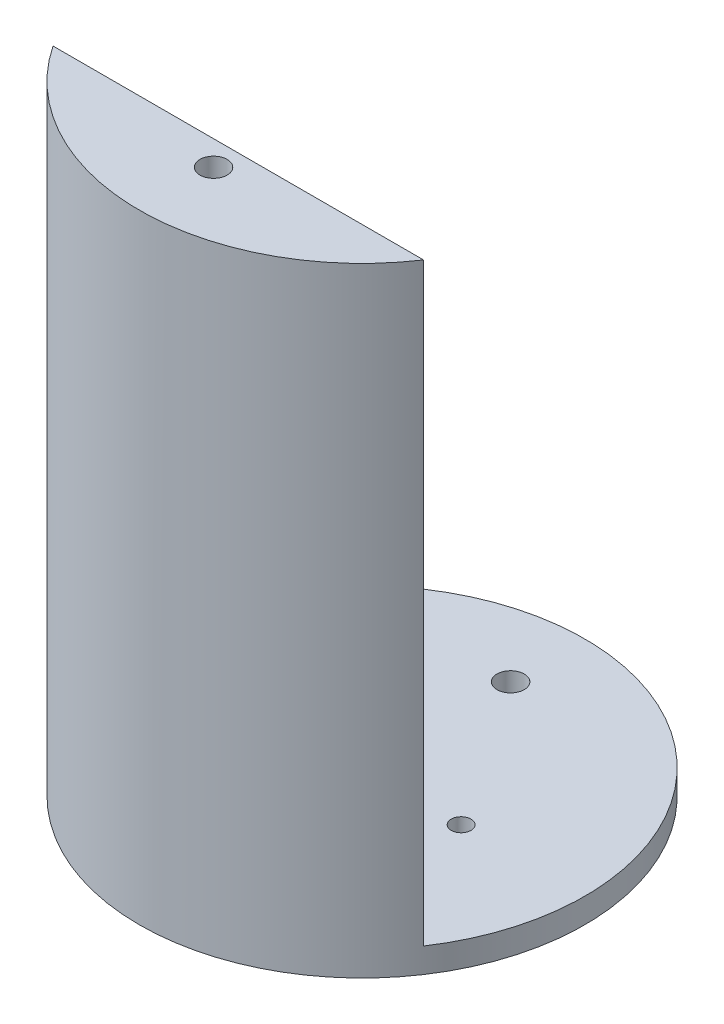
ISO-10303-21;
HEADER;
FILE_DESCRIPTION(('STEP AP214'),'2;1');
FILE_NAME('part.step','',(''),(''),'','','');
FILE_SCHEMA(('AUTOMOTIVE_DESIGN { 1 0 10303 214 1 1 1 1 }'));
ENDSEC;
DATA;
#1=APPLICATION_CONTEXT('core data for automotive mechanical design processes');
#2=APPLICATION_PROTOCOL_DEFINITION('international standard','automotive_design',2000,#1);
#3=PRODUCT_CONTEXT('',#1,'mechanical');
#4=PRODUCT('Part','Part','',(#3));
#5=PRODUCT_RELATED_PRODUCT_CATEGORY('part','',(#4));
#6=PRODUCT_DEFINITION_FORMATION('','',#4);
#7=PRODUCT_DEFINITION_CONTEXT('part definition',#1,'design');
#8=PRODUCT_DEFINITION('design','',#6,#7);
#9=PRODUCT_DEFINITION_SHAPE('','',#8);
#10=(LENGTH_UNIT() NAMED_UNIT(*) SI_UNIT(.MILLI.,.METRE.));
#11=(NAMED_UNIT(*) PLANE_ANGLE_UNIT() SI_UNIT($,.RADIAN.));
#12=(NAMED_UNIT(*) SI_UNIT($,.STERADIAN.) SOLID_ANGLE_UNIT());
#13=UNCERTAINTY_MEASURE_WITH_UNIT(LENGTH_MEASURE(1.E-05),#10,'distance_accuracy_value','');
#14=(GEOMETRIC_REPRESENTATION_CONTEXT(3) GLOBAL_UNCERTAINTY_ASSIGNED_CONTEXT((#13)) GLOBAL_UNIT_ASSIGNED_CONTEXT((#10,
#11,#12)) REPRESENTATION_CONTEXT('',''));
#15=CARTESIAN_POINT('',(0.,0.,0.));
#16=DIRECTION('',(0.,0.,1.));
#17=DIRECTION('',(1.,0.,0.));
#18=AXIS2_PLACEMENT_3D('',#15,#16,#17);
#19=CARTESIAN_POINT('',(0.,6.35,0.));
#20=DIRECTION('',(0.,1.,0.));
#21=DIRECTION('',(0.,0.,1.));
#22=AXIS2_PLACEMENT_3D('',#19,#20,#21);
#23=PLANE('',#22);
#24=CARTESIAN_POINT('',(0.,6.35,-38.1));
#25=DIRECTION('',(0.,1.,0.));
#26=DIRECTION('',(0.,0.,1.));
#27=AXIS2_PLACEMENT_3D('',#24,#25,#26);
#28=CIRCLE('',#27,3.4925);
#29=CARTESIAN_POINT('',(0.,6.35,-34.6075));
#30=VERTEX_POINT('',#29);
#31=EDGE_CURVE('E11',#30,#30,#28,.F.);
#32=ORIENTED_EDGE('',*,*,#31,.T.);
#33=EDGE_LOOP('',(#32));
#34=FACE_BOUND('',#33,.T.);
#35=CARTESIAN_POINT('',(0.,6.35,0.));
#36=DIRECTION('',(0.,1.,0.));
#37=DIRECTION('',(0.,0.,1.));
#38=AXIS2_PLACEMENT_3D('',#35,#36,#37);
#39=CIRCLE('',#38,6.35);
#40=CARTESIAN_POINT('',(0.,6.35,6.35));
#41=VERTEX_POINT('',#40);
#42=EDGE_CURVE('E92',#41,#41,#39,.T.);
#43=ORIENTED_EDGE('',*,*,#42,.F.);
#44=EDGE_LOOP('',(#43));
#45=FACE_BOUND('',#44,.T.);
#46=CARTESIAN_POINT('',(25.4,6.35,0.));
#47=DIRECTION('',(0.,1.,0.));
#48=DIRECTION('',(0.,0.,1.));
#49=AXIS2_PLACEMENT_3D('',#46,#47,#48);
#50=CIRCLE('',#49,2.52729999999999);
#51=CARTESIAN_POINT('',(25.4,6.35,2.52729999999999));
#52=VERTEX_POINT('',#51);
#53=EDGE_CURVE('E173',#52,#52,#50,.T.);
#54=ORIENTED_EDGE('',*,*,#53,.F.);
#55=EDGE_LOOP('',(#54));
#56=FACE_BOUND('',#55,.T.);
#57=CARTESIAN_POINT('',(-25.4,6.35,0.));
#58=DIRECTION('',(0.,1.,0.));
#59=DIRECTION('',(0.,0.,1.));
#60=AXIS2_PLACEMENT_3D('',#57,#58,#59);
#61=CIRCLE('',#60,2.52729999999999);
#62=CARTESIAN_POINT('',(-25.4,6.35,2.52729999999999));
#63=VERTEX_POINT('',#62);
#64=EDGE_CURVE('E83',#63,#63,#61,.T.);
#65=ORIENTED_EDGE('',*,*,#64,.F.);
#66=EDGE_LOOP('',(#65));
#67=FACE_BOUND('',#66,.T.);
#68=CARTESIAN_POINT('',(0.,6.35,0.));
#69=DIRECTION('',(0.,1.,0.));
#70=DIRECTION('',(0.,0.,1.));
#71=AXIS2_PLACEMENT_3D('',#68,#69,#70);
#72=CIRCLE('',#71,57.15);
#73=CARTESIAN_POINT('',(47.5190488120291,6.35,31.75));
#74=VERTEX_POINT('',#73);
#75=CARTESIAN_POINT('',(-47.5190488120291,6.35,31.75));
#76=VERTEX_POINT('',#75);
#77=EDGE_CURVE('E55',#74,#76,#72,.T.);
#78=ORIENTED_EDGE('',*,*,#77,.T.);
#79=DIRECTION('',(1.,0.,0.));
#80=VECTOR('',#79,1.);
#81=CARTESIAN_POINT('',(0.,6.35,31.75));
#82=LINE('',#81,#80);
#83=EDGE_CURVE('E85',#76,#74,#82,.T.);
#84=ORIENTED_EDGE('',*,*,#83,.T.);
#85=EDGE_LOOP('',(#78,#84));
#86=FACE_BOUND('',#85,.T.);
#87=ADVANCED_FACE('F45',(#34,#45,#56,#67,#86),#23,.T.);
#88=CARTESIAN_POINT('',(0.,6.35,38.1));
#89=DIRECTION('',(0.,-1.,0.));
#90=DIRECTION('',(0.,0.,-1.));
#91=AXIS2_PLACEMENT_3D('',#88,#89,#90);
#92=CYLINDRICAL_SURFACE('',#91,3.4925);
#93=CARTESIAN_POINT('',(0.,0.,38.1));
#94=DIRECTION('',(0.,1.,0.));
#95=DIRECTION('',(0.,0.,1.));
#96=AXIS2_PLACEMENT_3D('',#93,#94,#95);
#97=CIRCLE('',#96,3.4925);
#98=CARTESIAN_POINT('',(0.,0.,41.5925));
#99=VERTEX_POINT('',#98);
#100=EDGE_CURVE('E107',#99,#99,#97,.T.);
#101=ORIENTED_EDGE('',*,*,#100,.F.);
#102=EDGE_LOOP('',(#101));
#103=FACE_BOUND('',#102,.T.);
#104=CARTESIAN_POINT('',(0.,158.75,38.1));
#105=DIRECTION('',(0.,1.,0.));
#106=DIRECTION('',(0.,0.,1.));
#107=AXIS2_PLACEMENT_3D('',#104,#105,#106);
#108=CIRCLE('',#107,3.4925);
#109=CARTESIAN_POINT('',(0.,158.75,41.5925));
#110=VERTEX_POINT('',#109);
#111=EDGE_CURVE('E157',#110,#110,#108,.F.);
#112=ORIENTED_EDGE('',*,*,#111,.F.);
#113=EDGE_LOOP('',(#112));
#114=FACE_BOUND('',#113,.T.);
#115=ADVANCED_FACE('F136',(#103,#114),#92,.F.);
#116=CARTESIAN_POINT('',(0.,6.35,0.));
#117=DIRECTION('',(0.,-1.,0.));
#118=DIRECTION('',(0.,0.,-1.));
#119=AXIS2_PLACEMENT_3D('',#116,#117,#118);
#120=CYLINDRICAL_SURFACE('',#119,57.15);
#121=ORIENTED_EDGE('',*,*,#77,.F.);
#122=DIRECTION('',(0.,-1.,0.));
#123=VECTOR('',#122,1.);
#124=CARTESIAN_POINT('',(47.5190488120291,158.75,31.75));
#125=LINE('',#124,#123);
#126=CARTESIAN_POINT('',(47.5190488120291,158.75,31.75));
#127=VERTEX_POINT('',#126);
#128=EDGE_CURVE('E63',#127,#74,#125,.T.);
#129=ORIENTED_EDGE('',*,*,#128,.F.);
#130=CARTESIAN_POINT('',(0.,158.75,0.));
#131=DIRECTION('',(0.,1.,0.));
#132=DIRECTION('',(0.,0.,1.));
#133=AXIS2_PLACEMENT_3D('',#130,#131,#132);
#134=CIRCLE('',#133,57.15);
#135=CARTESIAN_POINT('',(-47.5190488120291,158.75,31.75));
#136=VERTEX_POINT('',#135);
#137=EDGE_CURVE('E71',#136,#127,#134,.T.);
#138=ORIENTED_EDGE('',*,*,#137,.F.);
#139=DIRECTION('',(0.,-1.,0.));
#140=VECTOR('',#139,1.);
#141=CARTESIAN_POINT('',(-47.5190488120291,158.75,31.75));
#142=LINE('',#141,#140);
#143=EDGE_CURVE('E78',#136,#76,#142,.T.);
#144=ORIENTED_EDGE('',*,*,#143,.T.);
#145=EDGE_LOOP('',(#121,#129,#138,#144));
#146=FACE_BOUND('',#145,.T.);
#147=CARTESIAN_POINT('',(0.,0.,0.));
#148=DIRECTION('',(0.,1.,0.));
#149=DIRECTION('',(0.,0.,1.));
#150=AXIS2_PLACEMENT_3D('',#147,#148,#149);
#151=CIRCLE('',#150,57.15);
#152=CARTESIAN_POINT('',(0.,0.,57.15));
#153=VERTEX_POINT('',#152);
#154=EDGE_CURVE('E103',#153,#153,#151,.T.);
#155=ORIENTED_EDGE('',*,*,#154,.T.);
#156=EDGE_LOOP('',(#155));
#157=FACE_BOUND('',#156,.T.);
#158=ADVANCED_FACE('F79',(#146,#157),#120,.T.);
#159=CARTESIAN_POINT('',(0.,6.35,0.));
#160=DIRECTION('',(0.,-1.,0.));
#161=DIRECTION('',(0.,0.,-1.));
#162=AXIS2_PLACEMENT_3D('',#159,#160,#161);
#163=CYLINDRICAL_SURFACE('',#162,6.35);
#164=ORIENTED_EDGE('',*,*,#42,.T.);
#165=EDGE_LOOP('',(#164));
#166=FACE_BOUND('',#165,.T.);
#167=CARTESIAN_POINT('',(0.,0.,0.));
#168=DIRECTION('',(0.,1.,0.));
#169=DIRECTION('',(0.,0.,1.));
#170=AXIS2_PLACEMENT_3D('',#167,#168,#169);
#171=CIRCLE('',#170,6.35);
#172=CARTESIAN_POINT('',(0.,0.,6.35));
#173=VERTEX_POINT('',#172);
#174=EDGE_CURVE('E99',#173,#173,#171,.T.);
#175=ORIENTED_EDGE('',*,*,#174,.F.);
#176=EDGE_LOOP('',(#175));
#177=FACE_BOUND('',#176,.T.);
#178=ADVANCED_FACE('F47',(#166,#177),#163,.F.);
#179=CARTESIAN_POINT('',(0.,6.35,-38.1));
#180=DIRECTION('',(0.,-1.,0.));
#181=DIRECTION('',(0.,0.,-1.));
#182=AXIS2_PLACEMENT_3D('',#179,#180,#181);
#183=CYLINDRICAL_SURFACE('',#182,3.4925);
#184=ORIENTED_EDGE('',*,*,#31,.F.);
#185=EDGE_LOOP('',(#184));
#186=FACE_BOUND('',#185,.T.);
#187=CARTESIAN_POINT('',(0.,0.,-38.1));
#188=DIRECTION('',(0.,1.,0.));
#189=DIRECTION('',(0.,0.,1.));
#190=AXIS2_PLACEMENT_3D('',#187,#188,#189);
#191=CIRCLE('',#190,3.4925);
#192=CARTESIAN_POINT('',(0.,0.,-34.6075));
#193=VERTEX_POINT('',#192);
#194=EDGE_CURVE('E49',#193,#193,#191,.F.);
#195=ORIENTED_EDGE('',*,*,#194,.T.);
#196=EDGE_LOOP('',(#195));
#197=FACE_BOUND('',#196,.T.);
#198=ADVANCED_FACE('F116',(#186,#197),#183,.F.);
#199=CARTESIAN_POINT('',(0.,0.,0.));
#200=DIRECTION('',(0.,1.,0.));
#201=DIRECTION('',(0.,0.,1.));
#202=AXIS2_PLACEMENT_3D('',#199,#200,#201);
#203=PLANE('',#202);
#204=CARTESIAN_POINT('',(-25.4,0.,0.));
#205=DIRECTION('',(0.,1.,0.));
#206=DIRECTION('',(0.,0.,1.));
#207=AXIS2_PLACEMENT_3D('',#204,#205,#206);
#208=CIRCLE('',#207,2.5273);
#209=CARTESIAN_POINT('',(-25.4,0.,2.5273));
#210=VERTEX_POINT('',#209);
#211=EDGE_CURVE('E170',#210,#210,#208,.T.);
#212=ORIENTED_EDGE('',*,*,#211,.T.);
#213=EDGE_LOOP('',(#212));
#214=FACE_BOUND('',#213,.T.);
#215=CARTESIAN_POINT('',(25.4,0.,0.));
#216=DIRECTION('',(0.,1.,0.));
#217=DIRECTION('',(0.,0.,1.));
#218=AXIS2_PLACEMENT_3D('',#215,#216,#217);
#219=CIRCLE('',#218,2.5273);
#220=CARTESIAN_POINT('',(25.4,0.,2.5273));
#221=VERTEX_POINT('',#220);
#222=EDGE_CURVE('E104',#221,#221,#219,.T.);
#223=ORIENTED_EDGE('',*,*,#222,.T.);
#224=EDGE_LOOP('',(#223));
#225=FACE_BOUND('',#224,.T.);
#226=ORIENTED_EDGE('',*,*,#174,.T.);
#227=EDGE_LOOP('',(#226));
#228=FACE_BOUND('',#227,.T.);
#229=ORIENTED_EDGE('',*,*,#154,.F.);
#230=EDGE_LOOP('',(#229));
#231=FACE_BOUND('',#230,.T.);
#232=ORIENTED_EDGE('',*,*,#100,.T.);
#233=EDGE_LOOP('',(#232));
#234=FACE_BOUND('',#233,.T.);
#235=ORIENTED_EDGE('',*,*,#194,.F.);
#236=EDGE_LOOP('',(#235));
#237=FACE_BOUND('',#236,.T.);
#238=ADVANCED_FACE('F118',(#214,#225,#228,#231,#234,#237),#203,.F.);
#239=CARTESIAN_POINT('',(25.4,6.35,0.));
#240=DIRECTION('',(0.,1.,0.));
#241=DIRECTION('',(0.,0.,1.));
#242=AXIS2_PLACEMENT_3D('',#239,#240,#241);
#243=CYLINDRICAL_SURFACE('',#242,2.52729999999999);
#244=ORIENTED_EDGE('',*,*,#222,.F.);
#245=EDGE_LOOP('',(#244));
#246=FACE_BOUND('',#245,.T.);
#247=ORIENTED_EDGE('',*,*,#53,.T.);
#248=EDGE_LOOP('',(#247));
#249=FACE_BOUND('',#248,.T.);
#250=ADVANCED_FACE('F120',(#246,#249),#243,.F.);
#251=CARTESIAN_POINT('',(-25.4,6.35,0.));
#252=DIRECTION('',(0.,1.,0.));
#253=DIRECTION('',(0.,0.,1.));
#254=AXIS2_PLACEMENT_3D('',#251,#252,#253);
#255=CYLINDRICAL_SURFACE('',#254,2.52729999999999);
#256=ORIENTED_EDGE('',*,*,#211,.F.);
#257=EDGE_LOOP('',(#256));
#258=FACE_BOUND('',#257,.T.);
#259=ORIENTED_EDGE('',*,*,#64,.T.);
#260=EDGE_LOOP('',(#259));
#261=FACE_BOUND('',#260,.T.);
#262=ADVANCED_FACE('F127',(#258,#261),#255,.F.);
#263=CARTESIAN_POINT('',(0.,158.75,31.75));
#264=DIRECTION('',(0.,0.,-1.));
#265=DIRECTION('',(-1.,0.,0.));
#266=AXIS2_PLACEMENT_3D('',#263,#264,#265);
#267=PLANE('',#266);
#268=ORIENTED_EDGE('',*,*,#83,.F.);
#269=ORIENTED_EDGE('',*,*,#143,.F.);
#270=DIRECTION('',(1.,0.,0.));
#271=VECTOR('',#270,1.);
#272=CARTESIAN_POINT('',(0.,158.75,31.75));
#273=LINE('',#272,#271);
#274=EDGE_CURVE('E89',#136,#127,#273,.T.);
#275=ORIENTED_EDGE('',*,*,#274,.T.);
#276=ORIENTED_EDGE('',*,*,#128,.T.);
#277=EDGE_LOOP('',(#268,#269,#275,#276));
#278=FACE_BOUND('',#277,.T.);
#279=ADVANCED_FACE('F86',(#278),#267,.T.);
#280=CARTESIAN_POINT('',(0.,158.75,0.));
#281=DIRECTION('',(0.,1.,0.));
#282=DIRECTION('',(0.,0.,1.));
#283=AXIS2_PLACEMENT_3D('',#280,#281,#282);
#284=PLANE('',#283);
#285=ORIENTED_EDGE('',*,*,#274,.F.);
#286=ORIENTED_EDGE('',*,*,#137,.T.);
#287=EDGE_LOOP('',(#285,#286));
#288=FACE_BOUND('',#287,.T.);
#289=ORIENTED_EDGE('',*,*,#111,.T.);
#290=EDGE_LOOP('',(#289));
#291=FACE_BOUND('',#290,.T.);
#292=ADVANCED_FACE('F150',(#288,#291),#284,.T.);
#293=CLOSED_SHELL('',(#87,#115,#158,#178,#198,#238,#250,#262,#279,#292));
#294=MANIFOLD_SOLID_BREP('B2',#293);
#295=ADVANCED_BREP_SHAPE_REPRESENTATION('',(#18,#294),#14);
#296=SHAPE_DEFINITION_REPRESENTATION(#9,#295);
ENDSEC;
END-ISO-10303-21;
